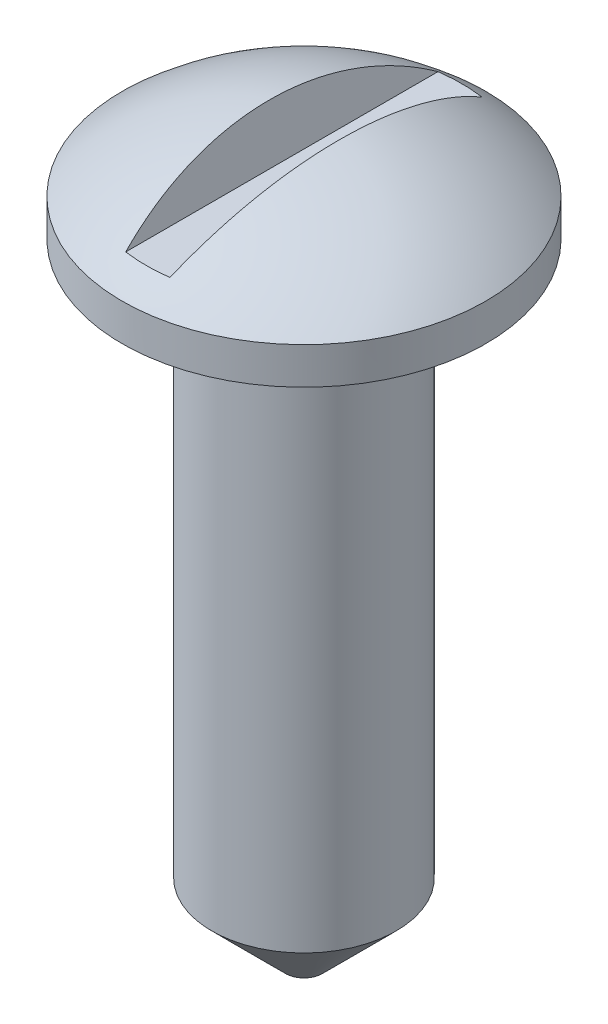
ISO-10303-21;
HEADER;
FILE_DESCRIPTION(('STEP AP214'),'2;1');
FILE_NAME('part.step','',(''),(''),'','','');
FILE_SCHEMA(('AUTOMOTIVE_DESIGN { 1 0 10303 214 1 1 1 1 }'));
ENDSEC;
DATA;
#1=APPLICATION_CONTEXT('core data for automotive mechanical design processes');
#2=APPLICATION_PROTOCOL_DEFINITION('international standard','automotive_design',2000,#1);
#3=PRODUCT_CONTEXT('',#1,'mechanical');
#4=PRODUCT('Part','Part','',(#3));
#5=PRODUCT_RELATED_PRODUCT_CATEGORY('part','',(#4));
#6=PRODUCT_DEFINITION_FORMATION('','',#4);
#7=PRODUCT_DEFINITION_CONTEXT('part definition',#1,'design');
#8=PRODUCT_DEFINITION('design','',#6,#7);
#9=PRODUCT_DEFINITION_SHAPE('','',#8);
#10=(LENGTH_UNIT() NAMED_UNIT(*) SI_UNIT(.MILLI.,.METRE.));
#11=(NAMED_UNIT(*) PLANE_ANGLE_UNIT() SI_UNIT($,.RADIAN.));
#12=(NAMED_UNIT(*) SI_UNIT($,.STERADIAN.) SOLID_ANGLE_UNIT());
#13=UNCERTAINTY_MEASURE_WITH_UNIT(LENGTH_MEASURE(1.E-05),#10,'distance_accuracy_value','');
#14=(GEOMETRIC_REPRESENTATION_CONTEXT(3) GLOBAL_UNCERTAINTY_ASSIGNED_CONTEXT((#13)) GLOBAL_UNIT_ASSIGNED_CONTEXT((#10,
#11,#12)) REPRESENTATION_CONTEXT('',''));
#15=CARTESIAN_POINT('',(0.,0.,0.));
#16=DIRECTION('',(0.,0.,1.));
#17=DIRECTION('',(1.,0.,0.));
#18=AXIS2_PLACEMENT_3D('',#15,#16,#17);
#19=CARTESIAN_POINT('',(0.,31.3600898728177,0.));
#20=DIRECTION('',(0.,-1.,0.));
#21=DIRECTION('',(-1.,0.,0.));
#22=AXIS2_PLACEMENT_3D('',#19,#20,#21);
#23=SPHERICAL_SURFACE('',#22,19.05);
#24=CARTESIAN_POINT('',(2.49245234660481,32.0279404662635,0.));
#25=DIRECTION('',(-0.96592582628907,-0.258819045102514,0.));
#26=DIRECTION('',(0.258819045102514,-0.96592582628907,0.));
#27=AXIS2_PLACEMENT_3D('',#24,#25,#26);
#28=CIRCLE('',#27,18.8744312996376);
#29=CARTESIAN_POINT('',(-1.52258245107185,47.0122543253503,-10.7514645807241));
#30=VERTEX_POINT('',#29);
#31=CARTESIAN_POINT('',(-1.52258245107185,47.0122543253503,10.7514645807241));
#32=VERTEX_POINT('',#31);
#33=EDGE_CURVE('E11',#30,#32,#28,.F.);
#34=ORIENTED_EDGE('',*,*,#33,.F.);
#35=CARTESIAN_POINT('',(0.,47.0122543253503,0.));
#36=DIRECTION('',(0.,-1.,0.));
#37=DIRECTION('',(0.,0.,-1.));
#38=AXIS2_PLACEMENT_3D('',#35,#36,#37);
#39=CIRCLE('',#38,10.8587406245327);
#40=CARTESIAN_POINT('',(1.52258245107185,47.0122543253503,-10.7514645807241));
#41=VERTEX_POINT('',#40);
#42=EDGE_CURVE('E75',#41,#30,#39,.F.);
#43=ORIENTED_EDGE('',*,*,#42,.F.);
#44=CARTESIAN_POINT('',(-2.49245234660481,32.0279404662635,0.));
#45=DIRECTION('',(0.96592582628907,-0.258819045102514,0.));
#46=DIRECTION('',(0.258819045102514,0.96592582628907,0.));
#47=AXIS2_PLACEMENT_3D('',#44,#45,#46);
#48=CIRCLE('',#47,18.8744312996376);
#49=CARTESIAN_POINT('',(1.52258245107185,47.0122543253503,10.7514645807241));
#50=VERTEX_POINT('',#49);
#51=EDGE_CURVE('E73',#50,#41,#48,.F.);
#52=ORIENTED_EDGE('',*,*,#51,.F.);
#53=EDGE_CURVE('E59',#32,#50,#39,.F.);
#54=ORIENTED_EDGE('',*,*,#53,.F.);
#55=EDGE_LOOP('',(#34,#43,#52,#54));
#56=FACE_BOUND('',#55,.T.);
#57=CARTESIAN_POINT('',(0.,45.72,0.));
#58=DIRECTION('',(0.,-1.,0.));
#59=DIRECTION('',(0.,0.,-1.));
#60=AXIS2_PLACEMENT_3D('',#57,#58,#59);
#61=CIRCLE('',#60,12.5178065626231);
#62=CARTESIAN_POINT('',(0.,45.72,-12.5178065626231));
#63=VERTEX_POINT('',#62);
#64=EDGE_CURVE('E103',#63,#63,#61,.T.);
#65=ORIENTED_EDGE('',*,*,#64,.F.);
#66=EDGE_LOOP('',(#65));
#67=FACE_BOUND('',#66,.T.);
#68=ADVANCED_FACE('F49',(#56,#67),#23,.T.);
#69=CARTESIAN_POINT('',(0.,-10.1361502347418,0.));
#70=DIRECTION('',(0.,-1.,0.));
#71=DIRECTION('',(0.,0.,-1.));
#72=AXIS2_PLACEMENT_3D('',#69,#70,#71);
#73=CYLINDRICAL_SURFACE('',#72,12.5178065626231);
#74=ORIENTED_EDGE('',*,*,#64,.T.);
#75=EDGE_LOOP('',(#74));
#76=FACE_BOUND('',#75,.T.);
#77=CARTESIAN_POINT('',(0.,43.18,0.));
#78=DIRECTION('',(0.,-1.,0.));
#79=DIRECTION('',(0.,0.,-1.));
#80=AXIS2_PLACEMENT_3D('',#77,#78,#79);
#81=CIRCLE('',#80,12.5178065626231);
#82=CARTESIAN_POINT('',(0.,43.18,-12.5178065626231));
#83=VERTEX_POINT('',#82);
#84=EDGE_CURVE('E99',#83,#83,#81,.T.);
#85=ORIENTED_EDGE('',*,*,#84,.F.);
#86=EDGE_LOOP('',(#85));
#87=FACE_BOUND('',#86,.T.);
#88=ADVANCED_FACE('F127',(#76,#87),#73,.T.);
#89=CARTESIAN_POINT('',(0.,43.18,0.));
#90=DIRECTION('',(0.,-1.,0.));
#91=DIRECTION('',(0.,0.,-1.));
#92=AXIS2_PLACEMENT_3D('',#89,#90,#91);
#93=PLANE('',#92);
#94=ORIENTED_EDGE('',*,*,#84,.T.);
#95=EDGE_LOOP('',(#94));
#96=FACE_BOUND('',#95,.T.);
#97=CARTESIAN_POINT('',(0.,43.18,0.));
#98=DIRECTION('',(0.,-1.,0.));
#99=DIRECTION('',(0.,0.,-1.));
#100=AXIS2_PLACEMENT_3D('',#97,#98,#99);
#101=CIRCLE('',#100,6.35);
#102=CARTESIAN_POINT('',(0.,43.18,-6.35));
#103=VERTEX_POINT('',#102);
#104=EDGE_CURVE('E93',#103,#103,#101,.T.);
#105=ORIENTED_EDGE('',*,*,#104,.F.);
#106=EDGE_LOOP('',(#105));
#107=FACE_BOUND('',#106,.T.);
#108=ADVANCED_FACE('F131',(#96,#107),#93,.T.);
#109=CARTESIAN_POINT('',(0.,-10.1361502347418,0.));
#110=DIRECTION('',(0.,-1.,0.));
#111=DIRECTION('',(0.,0.,-1.));
#112=AXIS2_PLACEMENT_3D('',#109,#110,#111);
#113=CYLINDRICAL_SURFACE('',#112,6.35);
#114=CARTESIAN_POINT('',(0.,5.08000000000001,0.));
#115=DIRECTION('',(0.,-1.,0.));
#116=DIRECTION('',(0.,0.,-1.));
#117=AXIS2_PLACEMENT_3D('',#114,#115,#116);
#118=CIRCLE('',#117,6.35);
#119=CARTESIAN_POINT('',(0.,5.08000000000001,-6.35));
#120=VERTEX_POINT('',#119);
#121=EDGE_CURVE('E80',#120,#120,#118,.F.);
#122=ORIENTED_EDGE('',*,*,#121,.T.);
#123=EDGE_LOOP('',(#122));
#124=FACE_BOUND('',#123,.T.);
#125=ORIENTED_EDGE('',*,*,#104,.T.);
#126=EDGE_LOOP('',(#125));
#127=FACE_BOUND('',#126,.T.);
#128=ADVANCED_FACE('F137',(#124,#127),#113,.T.);
#129=CARTESIAN_POINT('',(0.,0.,0.));
#130=DIRECTION('',(0.,-1.,0.));
#131=DIRECTION('',(0.,0.,-1.));
#132=AXIS2_PLACEMENT_3D('',#129,#130,#131);
#133=PLANE('',#132);
#134=CARTESIAN_POINT('',(0.,0.,0.));
#135=DIRECTION('',(0.,-1.,0.));
#136=DIRECTION('',(0.,0.,-1.));
#137=AXIS2_PLACEMENT_3D('',#134,#135,#136);
#138=CIRCLE('',#137,1.27000000000001);
#139=CARTESIAN_POINT('',(0.,0.,-1.27000000000001));
#140=VERTEX_POINT('',#139);
#141=EDGE_CURVE('E107',#140,#140,#138,.T.);
#142=ORIENTED_EDGE('',*,*,#141,.T.);
#143=EDGE_LOOP('',(#142));
#144=FACE_BOUND('',#143,.T.);
#145=ADVANCED_FACE('F123',(#144),#133,.T.);
#146=CARTESIAN_POINT('',(0.,0.,0.));
#147=DIRECTION('',(0.,1.,0.));
#148=DIRECTION('',(0.,0.,1.));
#149=AXIS2_PLACEMENT_3D('',#146,#147,#148);
#150=CONICAL_SURFACE('',#149,1.27000000000001,0.785398163397446);
#151=ORIENTED_EDGE('',*,*,#121,.F.);
#152=EDGE_LOOP('',(#151));
#153=FACE_BOUND('',#152,.T.);
#154=ORIENTED_EDGE('',*,*,#141,.F.);
#155=EDGE_LOOP('',(#154));
#156=FACE_BOUND('',#155,.T.);
#157=ADVANCED_FACE('F52',(#153,#156),#150,.T.);
#158=CARTESIAN_POINT('',(-2.39260993922039,50.2592411151022,92.6490947286537));
#159=DIRECTION('',(-0.96592582628907,-0.258819045102514,0.));
#160=DIRECTION('',(0.258819045102514,-0.96592582628907,0.));
#161=AXIS2_PLACEMENT_3D('',#158,#159,#160);
#162=PLANE('',#161);
#163=DIRECTION('',(0.,0.,-1.));
#164=VECTOR('',#163,1.);
#165=CARTESIAN_POINT('',(-1.52258245107185,47.0122543253503,92.6490947286537));
#166=LINE('',#165,#164);
#167=EDGE_CURVE('E87',#32,#30,#166,.T.);
#168=ORIENTED_EDGE('',*,*,#167,.T.);
#169=ORIENTED_EDGE('',*,*,#33,.T.);
#170=EDGE_LOOP('',(#168,#169));
#171=FACE_BOUND('',#170,.T.);
#172=ADVANCED_FACE('F115',(#171),#162,.F.);
#173=CARTESIAN_POINT('',(-1.52258245107185,47.0122543253503,92.6490947286537));
#174=DIRECTION('',(0.,-1.,0.));
#175=DIRECTION('',(0.,0.,-1.));
#176=AXIS2_PLACEMENT_3D('',#173,#174,#175);
#177=PLANE('',#176);
#178=ORIENTED_EDGE('',*,*,#167,.F.);
#179=ORIENTED_EDGE('',*,*,#53,.T.);
#180=DIRECTION('',(0.,0.,-1.));
#181=VECTOR('',#180,1.);
#182=CARTESIAN_POINT('',(1.52258245107185,47.0122543253503,92.6490947286537));
#183=LINE('',#182,#181);
#184=EDGE_CURVE('E85',#50,#41,#183,.T.);
#185=ORIENTED_EDGE('',*,*,#184,.T.);
#186=ORIENTED_EDGE('',*,*,#42,.T.);
#187=EDGE_LOOP('',(#178,#179,#185,#186));
#188=FACE_BOUND('',#187,.T.);
#189=ADVANCED_FACE('F84',(#188),#177,.F.);
#190=CARTESIAN_POINT('',(2.39260993922039,50.2592411151022,92.6490947286537));
#191=DIRECTION('',(0.96592582628907,-0.258819045102514,0.));
#192=DIRECTION('',(0.258819045102514,0.96592582628907,0.));
#193=AXIS2_PLACEMENT_3D('',#190,#191,#192);
#194=PLANE('',#193);
#195=ORIENTED_EDGE('',*,*,#51,.T.);
#196=ORIENTED_EDGE('',*,*,#184,.F.);
#197=EDGE_LOOP('',(#195,#196));
#198=FACE_BOUND('',#197,.T.);
#199=ADVANCED_FACE('F89',(#198),#194,.F.);
#200=CLOSED_SHELL('',(#68,#88,#108,#128,#145,#157,#172,#189,#199));
#201=MANIFOLD_SOLID_BREP('B2',#200);
#202=ADVANCED_BREP_SHAPE_REPRESENTATION('',(#18,#201),#14);
#203=SHAPE_DEFINITION_REPRESENTATION(#9,#202);
ENDSEC;
END-ISO-10303-21;
